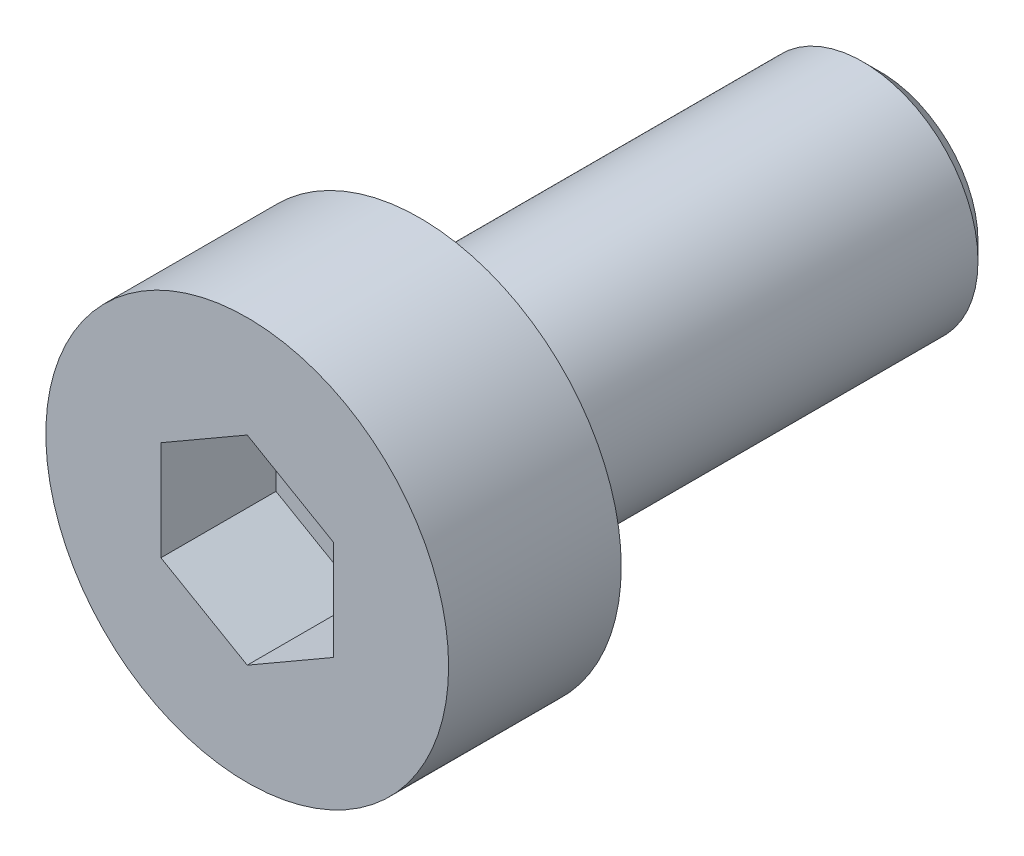
ISO-10303-21;
HEADER;
FILE_DESCRIPTION(('STEP AP214'),'2;1');
FILE_NAME('part.step','',(''),(''),'','','');
FILE_SCHEMA(('AUTOMOTIVE_DESIGN { 1 0 10303 214 1 1 1 1 }'));
ENDSEC;
DATA;
#1=APPLICATION_CONTEXT('core data for automotive mechanical design processes');
#2=APPLICATION_PROTOCOL_DEFINITION('international standard','automotive_design',2000,#1);
#3=PRODUCT_CONTEXT('',#1,'mechanical');
#4=PRODUCT('Part','Part','',(#3));
#5=PRODUCT_RELATED_PRODUCT_CATEGORY('part','',(#4));
#6=PRODUCT_DEFINITION_FORMATION('','',#4);
#7=PRODUCT_DEFINITION_CONTEXT('part definition',#1,'design');
#8=PRODUCT_DEFINITION('design','',#6,#7);
#9=PRODUCT_DEFINITION_SHAPE('','',#8);
#10=(LENGTH_UNIT() NAMED_UNIT(*) SI_UNIT(.MILLI.,.METRE.));
#11=(NAMED_UNIT(*) PLANE_ANGLE_UNIT() SI_UNIT($,.RADIAN.));
#12=(NAMED_UNIT(*) SI_UNIT($,.STERADIAN.) SOLID_ANGLE_UNIT());
#13=UNCERTAINTY_MEASURE_WITH_UNIT(LENGTH_MEASURE(1.E-05),#10,'distance_accuracy_value','');
#14=(GEOMETRIC_REPRESENTATION_CONTEXT(3) GLOBAL_UNCERTAINTY_ASSIGNED_CONTEXT((#13)) GLOBAL_UNIT_ASSIGNED_CONTEXT((#10,
#11,#12)) REPRESENTATION_CONTEXT('',''));
#15=CARTESIAN_POINT('',(0.,0.,0.));
#16=DIRECTION('',(0.,0.,1.));
#17=DIRECTION('',(1.,0.,0.));
#18=AXIS2_PLACEMENT_3D('',#15,#16,#17);
#19=CARTESIAN_POINT('',(0.,0.,0.));
#20=DIRECTION('',(0.,0.,1.));
#21=DIRECTION('',(1.,0.,0.));
#22=AXIS2_PLACEMENT_3D('',#19,#20,#21);
#23=PLANE('',#22);
#24=CARTESIAN_POINT('',(0.,0.,0.));
#25=DIRECTION('',(0.,0.,1.));
#26=DIRECTION('',(1.,0.,0.));
#27=AXIS2_PLACEMENT_3D('',#24,#25,#26);
#28=CIRCLE('',#27,3.5);
#29=CARTESIAN_POINT('',(3.5,0.,0.));
#30=VERTEX_POINT('',#29);
#31=EDGE_CURVE('E135',#30,#30,#28,.T.);
#32=ORIENTED_EDGE('',*,*,#31,.F.);
#33=EDGE_LOOP('',(#32));
#34=FACE_BOUND('',#33,.T.);
#35=CARTESIAN_POINT('',(0.,0.,0.));
#36=DIRECTION('',(0.,0.,1.));
#37=DIRECTION('',(1.,0.,0.));
#38=AXIS2_PLACEMENT_3D('',#35,#36,#37);
#39=CIRCLE('',#38,2.);
#40=CARTESIAN_POINT('',(2.,0.,0.));
#41=VERTEX_POINT('',#40);
#42=EDGE_CURVE('E144',#41,#41,#39,.F.);
#43=ORIENTED_EDGE('',*,*,#42,.F.);
#44=EDGE_LOOP('',(#43));
#45=FACE_BOUND('',#44,.T.);
#46=ADVANCED_FACE('F33',(#34,#45),#23,.F.);
#47=CARTESIAN_POINT('',(0.,0.,3.));
#48=DIRECTION('',(0.,0.,-1.));
#49=DIRECTION('',(-1.,0.,0.));
#50=AXIS2_PLACEMENT_3D('',#47,#48,#49);
#51=CYLINDRICAL_SURFACE('',#50,3.5);
#52=CARTESIAN_POINT('',(0.,0.,3.));
#53=DIRECTION('',(0.,0.,1.));
#54=DIRECTION('',(1.,0.,0.));
#55=AXIS2_PLACEMENT_3D('',#52,#53,#54);
#56=CIRCLE('',#55,3.5);
#57=CARTESIAN_POINT('',(3.5,0.,3.));
#58=VERTEX_POINT('',#57);
#59=EDGE_CURVE('E141',#58,#58,#56,.T.);
#60=ORIENTED_EDGE('',*,*,#59,.F.);
#61=EDGE_LOOP('',(#60));
#62=FACE_BOUND('',#61,.T.);
#63=ORIENTED_EDGE('',*,*,#31,.T.);
#64=EDGE_LOOP('',(#63));
#65=FACE_BOUND('',#64,.T.);
#66=ADVANCED_FACE('F166',(#62,#65),#51,.T.);
#67=CARTESIAN_POINT('',(0.,0.,3.));
#68=DIRECTION('',(0.,0.,1.));
#69=DIRECTION('',(1.,0.,0.));
#70=AXIS2_PLACEMENT_3D('',#67,#68,#69);
#71=PLANE('',#70);
#72=DIRECTION('',(-0.866025403784439,0.5,0.));
#73=VECTOR('',#72,1.);
#74=CARTESIAN_POINT('',(1.5,0.866025403784439,3.));
#75=LINE('',#74,#73);
#76=CARTESIAN_POINT('',(1.5,0.866025403784439,3.));
#77=VERTEX_POINT('',#76);
#78=CARTESIAN_POINT('',(0.,1.73205080756888,3.));
#79=VERTEX_POINT('',#78);
#80=EDGE_CURVE('E48',#77,#79,#75,.T.);
#81=ORIENTED_EDGE('',*,*,#80,.F.);
#82=DIRECTION('',(0.,1.,0.));
#83=VECTOR('',#82,1.);
#84=CARTESIAN_POINT('',(1.5,-0.866025403784439,3.));
#85=LINE('',#84,#83);
#86=CARTESIAN_POINT('',(1.5,-0.866025403784439,3.));
#87=VERTEX_POINT('',#86);
#88=EDGE_CURVE('E131',#87,#77,#85,.T.);
#89=ORIENTED_EDGE('',*,*,#88,.F.);
#90=DIRECTION('',(0.866025403784439,0.5,0.));
#91=VECTOR('',#90,1.);
#92=CARTESIAN_POINT('',(0.,-1.73205080756888,3.));
#93=LINE('',#92,#91);
#94=CARTESIAN_POINT('',(0.,-1.73205080756888,3.));
#95=VERTEX_POINT('',#94);
#96=EDGE_CURVE('E129',#95,#87,#93,.T.);
#97=ORIENTED_EDGE('',*,*,#96,.F.);
#98=DIRECTION('',(0.866025403784439,-0.5,0.));
#99=VECTOR('',#98,1.);
#100=CARTESIAN_POINT('',(-1.5,-0.866025403784439,3.));
#101=LINE('',#100,#99);
#102=CARTESIAN_POINT('',(-1.5,-0.866025403784439,3.));
#103=VERTEX_POINT('',#102);
#104=EDGE_CURVE('E96',#103,#95,#101,.T.);
#105=ORIENTED_EDGE('',*,*,#104,.F.);
#106=DIRECTION('',(0.,-1.,0.));
#107=VECTOR('',#106,1.);
#108=CARTESIAN_POINT('',(-1.5,0.866025403784439,3.));
#109=LINE('',#108,#107);
#110=CARTESIAN_POINT('',(-1.5,0.866025403784439,3.));
#111=VERTEX_POINT('',#110);
#112=EDGE_CURVE('E125',#111,#103,#109,.T.);
#113=ORIENTED_EDGE('',*,*,#112,.F.);
#114=DIRECTION('',(-0.866025403784439,-0.5,0.));
#115=VECTOR('',#114,1.);
#116=CARTESIAN_POINT('',(0.,1.73205080756888,3.));
#117=LINE('',#116,#115);
#118=EDGE_CURVE('E122',#79,#111,#117,.T.);
#119=ORIENTED_EDGE('',*,*,#118,.F.);
#120=EDGE_LOOP('',(#81,#89,#97,#105,#113,#119));
#121=FACE_BOUND('',#120,.T.);
#122=ORIENTED_EDGE('',*,*,#59,.T.);
#123=EDGE_LOOP('',(#122));
#124=FACE_BOUND('',#123,.T.);
#125=ADVANCED_FACE('F172',(#121,#124),#71,.T.);
#126=CARTESIAN_POINT('',(0.,0.,-8.));
#127=DIRECTION('',(0.,0.,1.));
#128=DIRECTION('',(1.,0.,0.));
#129=AXIS2_PLACEMENT_3D('',#126,#127,#128);
#130=CYLINDRICAL_SURFACE('',#129,2.);
#131=CARTESIAN_POINT('',(0.,0.,-7.7));
#132=DIRECTION('',(0.,0.,-1.));
#133=DIRECTION('',(-1.,0.,0.));
#134=AXIS2_PLACEMENT_3D('',#131,#132,#133);
#135=CIRCLE('',#134,2.);
#136=CARTESIAN_POINT('',(-2.,0.,-7.7));
#137=VERTEX_POINT('',#136);
#138=EDGE_CURVE('E11',#137,#137,#135,.F.);
#139=ORIENTED_EDGE('',*,*,#138,.T.);
#140=EDGE_LOOP('',(#139));
#141=FACE_BOUND('',#140,.T.);
#142=ORIENTED_EDGE('',*,*,#42,.T.);
#143=EDGE_LOOP('',(#142));
#144=FACE_BOUND('',#143,.T.);
#145=ADVANCED_FACE('F162',(#141,#144),#130,.T.);
#146=CARTESIAN_POINT('',(0.,0.,-8.));
#147=DIRECTION('',(0.,0.,-1.));
#148=DIRECTION('',(-1.,0.,0.));
#149=AXIS2_PLACEMENT_3D('',#146,#147,#148);
#150=PLANE('',#149);
#151=CARTESIAN_POINT('',(0.,0.,-8.));
#152=DIRECTION('',(0.,0.,-1.));
#153=DIRECTION('',(-1.,0.,0.));
#154=AXIS2_PLACEMENT_3D('',#151,#152,#153);
#155=CIRCLE('',#154,1.70000000000001);
#156=CARTESIAN_POINT('',(-1.70000000000001,0.,-8.));
#157=VERTEX_POINT('',#156);
#158=EDGE_CURVE('E41',#157,#157,#155,.T.);
#159=ORIENTED_EDGE('',*,*,#158,.T.);
#160=EDGE_LOOP('',(#159));
#161=FACE_BOUND('',#160,.T.);
#162=ADVANCED_FACE('F151',(#161),#150,.T.);
#163=CARTESIAN_POINT('',(0.,0.,-8.));
#164=DIRECTION('',(0.,0.,1.));
#165=DIRECTION('',(1.,0.,0.));
#166=AXIS2_PLACEMENT_3D('',#163,#164,#165);
#167=CONICAL_SURFACE('',#166,1.70000000000001,0.785398163397447);
#168=ORIENTED_EDGE('',*,*,#138,.F.);
#169=EDGE_LOOP('',(#168));
#170=FACE_BOUND('',#169,.T.);
#171=ORIENTED_EDGE('',*,*,#158,.F.);
#172=EDGE_LOOP('',(#171));
#173=FACE_BOUND('',#172,.T.);
#174=ADVANCED_FACE('F35',(#170,#173),#167,.T.);
#175=CARTESIAN_POINT('',(1.5,0.866025403784439,1.));
#176=DIRECTION('',(0.5,0.866025403784439,0.));
#177=DIRECTION('',(-0.866025403784439,0.5,0.));
#178=AXIS2_PLACEMENT_3D('',#175,#176,#177);
#179=PLANE('',#178);
#180=ORIENTED_EDGE('',*,*,#80,.T.);
#181=DIRECTION('',(0.,0.,1.));
#182=VECTOR('',#181,1.);
#183=CARTESIAN_POINT('',(0.,1.73205080756888,1.));
#184=LINE('',#183,#182);
#185=CARTESIAN_POINT('',(0.,1.73205080756888,1.));
#186=VERTEX_POINT('',#185);
#187=EDGE_CURVE('E78',#186,#79,#184,.T.);
#188=ORIENTED_EDGE('',*,*,#187,.F.);
#189=DIRECTION('',(-0.866025403784439,0.5,0.));
#190=VECTOR('',#189,1.);
#191=CARTESIAN_POINT('',(1.5,0.866025403784439,1.));
#192=LINE('',#191,#190);
#193=CARTESIAN_POINT('',(1.5,0.866025403784439,1.));
#194=VERTEX_POINT('',#193);
#195=EDGE_CURVE('E133',#194,#186,#192,.T.);
#196=ORIENTED_EDGE('',*,*,#195,.F.);
#197=DIRECTION('',(0.,0.,1.));
#198=VECTOR('',#197,1.);
#199=CARTESIAN_POINT('',(1.5,0.866025403784439,1.));
#200=LINE('',#199,#198);
#201=EDGE_CURVE('E56',#194,#77,#200,.T.);
#202=ORIENTED_EDGE('',*,*,#201,.T.);
#203=EDGE_LOOP('',(#180,#188,#196,#202));
#204=FACE_BOUND('',#203,.T.);
#205=ADVANCED_FACE('F154',(#204),#179,.F.);
#206=CARTESIAN_POINT('',(1.5,-0.866025403784439,1.));
#207=DIRECTION('',(1.,0.,0.));
#208=DIRECTION('',(0.,1.,0.));
#209=AXIS2_PLACEMENT_3D('',#206,#207,#208);
#210=PLANE('',#209);
#211=ORIENTED_EDGE('',*,*,#88,.T.);
#212=ORIENTED_EDGE('',*,*,#201,.F.);
#213=DIRECTION('',(0.,1.,0.));
#214=VECTOR('',#213,1.);
#215=CARTESIAN_POINT('',(1.5,-0.866025403784439,1.));
#216=LINE('',#215,#214);
#217=CARTESIAN_POINT('',(1.5,-0.866025403784439,1.));
#218=VERTEX_POINT('',#217);
#219=EDGE_CURVE('E108',#218,#194,#216,.T.);
#220=ORIENTED_EDGE('',*,*,#219,.F.);
#221=DIRECTION('',(0.,0.,1.));
#222=VECTOR('',#221,1.);
#223=CARTESIAN_POINT('',(1.5,-0.866025403784439,1.));
#224=LINE('',#223,#222);
#225=EDGE_CURVE('E100',#218,#87,#224,.T.);
#226=ORIENTED_EDGE('',*,*,#225,.T.);
#227=EDGE_LOOP('',(#211,#212,#220,#226));
#228=FACE_BOUND('',#227,.T.);
#229=ADVANCED_FACE('F160',(#228),#210,.F.);
#230=CARTESIAN_POINT('',(0.,-1.73205080756888,1.));
#231=DIRECTION('',(0.5,-0.866025403784439,0.));
#232=DIRECTION('',(0.866025403784439,0.5,0.));
#233=AXIS2_PLACEMENT_3D('',#230,#231,#232);
#234=PLANE('',#233);
#235=ORIENTED_EDGE('',*,*,#96,.T.);
#236=ORIENTED_EDGE('',*,*,#225,.F.);
#237=DIRECTION('',(0.866025403784439,0.5,0.));
#238=VECTOR('',#237,1.);
#239=CARTESIAN_POINT('',(0.,-1.73205080756888,1.));
#240=LINE('',#239,#238);
#241=CARTESIAN_POINT('',(0.,-1.73205080756888,1.));
#242=VERTEX_POINT('',#241);
#243=EDGE_CURVE('E104',#242,#218,#240,.T.);
#244=ORIENTED_EDGE('',*,*,#243,.F.);
#245=DIRECTION('',(0.,0.,1.));
#246=VECTOR('',#245,1.);
#247=CARTESIAN_POINT('',(0.,-1.73205080756888,1.));
#248=LINE('',#247,#246);
#249=EDGE_CURVE('E89',#242,#95,#248,.T.);
#250=ORIENTED_EDGE('',*,*,#249,.T.);
#251=EDGE_LOOP('',(#235,#236,#244,#250));
#252=FACE_BOUND('',#251,.T.);
#253=ADVANCED_FACE('F105',(#252),#234,.F.);
#254=CARTESIAN_POINT('',(-1.5,-0.866025403784439,1.));
#255=DIRECTION('',(-0.5,-0.866025403784439,0.));
#256=DIRECTION('',(0.866025403784439,-0.5,0.));
#257=AXIS2_PLACEMENT_3D('',#254,#255,#256);
#258=PLANE('',#257);
#259=ORIENTED_EDGE('',*,*,#104,.T.);
#260=ORIENTED_EDGE('',*,*,#249,.F.);
#261=DIRECTION('',(0.866025403784439,-0.5,0.));
#262=VECTOR('',#261,1.);
#263=CARTESIAN_POINT('',(-1.5,-0.866025403784439,1.));
#264=LINE('',#263,#262);
#265=CARTESIAN_POINT('',(-1.5,-0.866025403784439,1.));
#266=VERTEX_POINT('',#265);
#267=EDGE_CURVE('E93',#266,#242,#264,.T.);
#268=ORIENTED_EDGE('',*,*,#267,.F.);
#269=DIRECTION('',(0.,0.,1.));
#270=VECTOR('',#269,1.);
#271=CARTESIAN_POINT('',(-1.5,-0.866025403784439,1.));
#272=LINE('',#271,#270);
#273=EDGE_CURVE('E101',#266,#103,#272,.T.);
#274=ORIENTED_EDGE('',*,*,#273,.T.);
#275=EDGE_LOOP('',(#259,#260,#268,#274));
#276=FACE_BOUND('',#275,.T.);
#277=ADVANCED_FACE('F91',(#276),#258,.F.);
#278=CARTESIAN_POINT('',(-1.5,0.866025403784439,1.));
#279=DIRECTION('',(-1.,0.,0.));
#280=DIRECTION('',(0.,0.,1.));
#281=AXIS2_PLACEMENT_3D('',#278,#279,#280);
#282=PLANE('',#281);
#283=ORIENTED_EDGE('',*,*,#112,.T.);
#284=ORIENTED_EDGE('',*,*,#273,.F.);
#285=DIRECTION('',(0.,-1.,0.));
#286=VECTOR('',#285,1.);
#287=CARTESIAN_POINT('',(-1.5,0.866025403784439,1.));
#288=LINE('',#287,#286);
#289=CARTESIAN_POINT('',(-1.5,0.866025403784439,1.));
#290=VERTEX_POINT('',#289);
#291=EDGE_CURVE('E114',#290,#266,#288,.T.);
#292=ORIENTED_EDGE('',*,*,#291,.F.);
#293=DIRECTION('',(0.,0.,1.));
#294=VECTOR('',#293,1.);
#295=CARTESIAN_POINT('',(-1.5,0.866025403784439,1.));
#296=LINE('',#295,#294);
#297=EDGE_CURVE('E138',#290,#111,#296,.T.);
#298=ORIENTED_EDGE('',*,*,#297,.T.);
#299=EDGE_LOOP('',(#283,#284,#292,#298));
#300=FACE_BOUND('',#299,.T.);
#301=ADVANCED_FACE('F186',(#300),#282,.F.);
#302=CARTESIAN_POINT('',(0.,1.73205080756888,1.));
#303=DIRECTION('',(-0.5,0.866025403784439,0.));
#304=DIRECTION('',(-0.866025403784439,-0.5,0.));
#305=AXIS2_PLACEMENT_3D('',#302,#303,#304);
#306=PLANE('',#305);
#307=ORIENTED_EDGE('',*,*,#118,.T.);
#308=ORIENTED_EDGE('',*,*,#297,.F.);
#309=DIRECTION('',(-0.866025403784439,-0.5,0.));
#310=VECTOR('',#309,1.);
#311=CARTESIAN_POINT('',(0.,1.73205080756888,1.));
#312=LINE('',#311,#310);
#313=EDGE_CURVE('E116',#186,#290,#312,.T.);
#314=ORIENTED_EDGE('',*,*,#313,.F.);
#315=ORIENTED_EDGE('',*,*,#187,.T.);
#316=EDGE_LOOP('',(#307,#308,#314,#315));
#317=FACE_BOUND('',#316,.T.);
#318=ADVANCED_FACE('F183',(#317),#306,.F.);
#319=CARTESIAN_POINT('',(0.,0.,1.));
#320=DIRECTION('',(0.,0.,1.));
#321=DIRECTION('',(1.,0.,0.));
#322=AXIS2_PLACEMENT_3D('',#319,#320,#321);
#323=PLANE('',#322);
#324=ORIENTED_EDGE('',*,*,#195,.T.);
#325=ORIENTED_EDGE('',*,*,#313,.T.);
#326=ORIENTED_EDGE('',*,*,#291,.T.);
#327=ORIENTED_EDGE('',*,*,#267,.T.);
#328=ORIENTED_EDGE('',*,*,#243,.T.);
#329=ORIENTED_EDGE('',*,*,#219,.T.);
#330=EDGE_LOOP('',(#324,#325,#326,#327,#328,#329));
#331=FACE_BOUND('',#330,.T.);
#332=ADVANCED_FACE('F111',(#331),#323,.T.);
#333=CLOSED_SHELL('',(#46,#66,#125,#145,#162,#174,#205,#229,#253,#277,#301,#318,#332));
#334=MANIFOLD_SOLID_BREP('B2',#333);
#335=ADVANCED_BREP_SHAPE_REPRESENTATION('',(#18,#334),#14);
#336=SHAPE_DEFINITION_REPRESENTATION(#9,#335);
ENDSEC;
END-ISO-10303-21;
